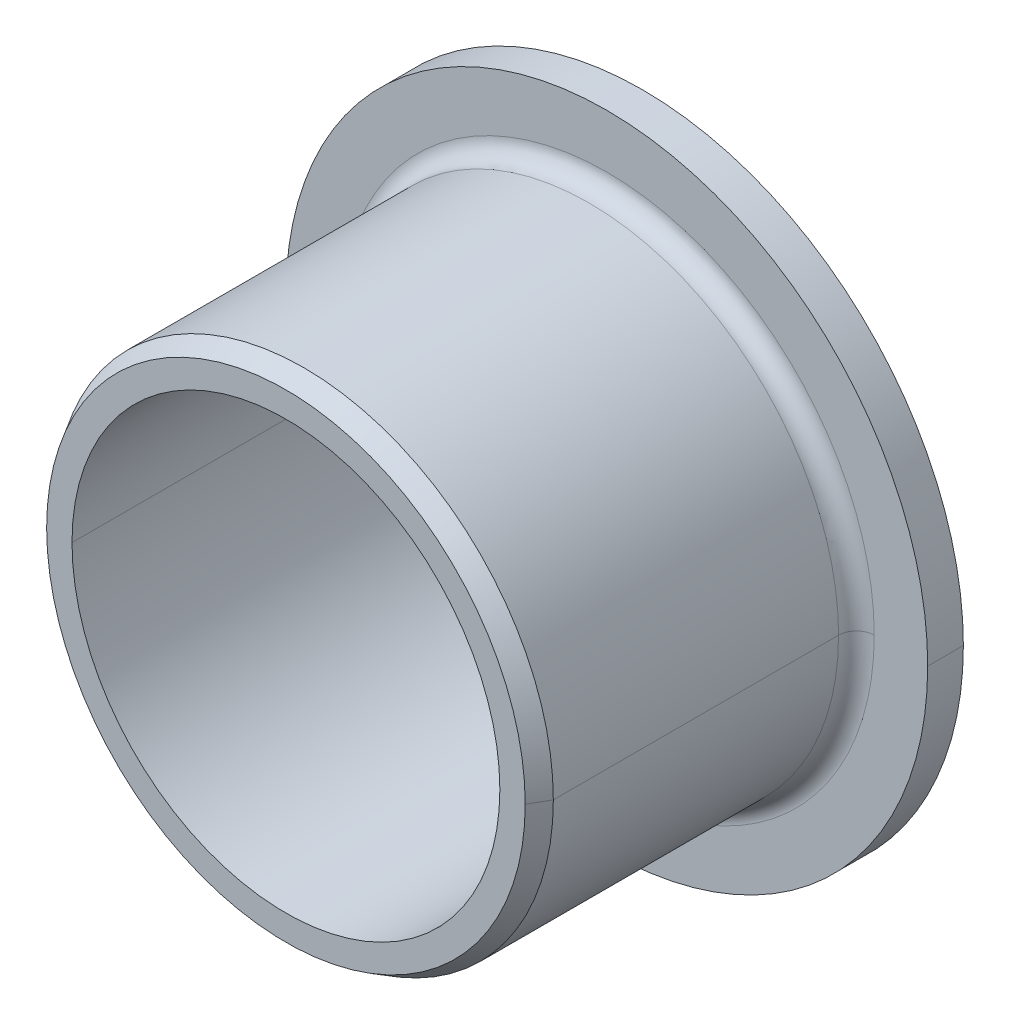
ISO-10303-21;
HEADER;
FILE_DESCRIPTION(('STEP AP214'),'2;1');
FILE_NAME('part.step','',(''),(''),'','','');
FILE_SCHEMA(('AUTOMOTIVE_DESIGN { 1 0 10303 214 1 1 1 1 }'));
ENDSEC;
DATA;
#1=APPLICATION_CONTEXT('core data for automotive mechanical design processes');
#2=APPLICATION_PROTOCOL_DEFINITION('international standard','automotive_design',2000,#1);
#3=PRODUCT_CONTEXT('',#1,'mechanical');
#4=PRODUCT('Part','Part','',(#3));
#5=PRODUCT_RELATED_PRODUCT_CATEGORY('part','',(#4));
#6=PRODUCT_DEFINITION_FORMATION('','',#4);
#7=PRODUCT_DEFINITION_CONTEXT('part definition',#1,'design');
#8=PRODUCT_DEFINITION('design','',#6,#7);
#9=PRODUCT_DEFINITION_SHAPE('','',#8);
#10=(LENGTH_UNIT() NAMED_UNIT(*) SI_UNIT(.MILLI.,.METRE.));
#11=(NAMED_UNIT(*) PLANE_ANGLE_UNIT() SI_UNIT($,.RADIAN.));
#12=(NAMED_UNIT(*) SI_UNIT($,.STERADIAN.) SOLID_ANGLE_UNIT());
#13=UNCERTAINTY_MEASURE_WITH_UNIT(LENGTH_MEASURE(1.E-05),#10,'distance_accuracy_value','');
#14=(GEOMETRIC_REPRESENTATION_CONTEXT(3) GLOBAL_UNCERTAINTY_ASSIGNED_CONTEXT((#13)) GLOBAL_UNIT_ASSIGNED_CONTEXT((#10,
#11,#12)) REPRESENTATION_CONTEXT('',''));
#15=CARTESIAN_POINT('',(0.,0.,0.));
#16=DIRECTION('',(0.,0.,1.));
#17=DIRECTION('',(1.,0.,0.));
#18=AXIS2_PLACEMENT_3D('',#15,#16,#17);
#19=CARTESIAN_POINT('',(7.5,0.,0.));
#20=DIRECTION('',(0.,0.,-1.));
#21=DIRECTION('',(0.,-1.,0.));
#22=AXIS2_PLACEMENT_3D('',#19,#20,#21);
#23=PLANE('',#22);
#24=CARTESIAN_POINT('',(0.,0.,0.));
#25=DIRECTION('',(0.,0.,1.));
#26=DIRECTION('',(1.,0.,0.));
#27=AXIS2_PLACEMENT_3D('',#24,#25,#26);
#28=CIRCLE('',#27,6.);
#29=CARTESIAN_POINT('',(6.,0.,0.));
#30=VERTEX_POINT('',#29);
#31=CARTESIAN_POINT('',(-6.,0.,0.));
#32=VERTEX_POINT('',#31);
#33=EDGE_CURVE('E10',#30,#32,#28,.T.);
#34=ORIENTED_EDGE('',*,*,#33,.T.);
#35=CARTESIAN_POINT('',(0.,0.,0.));
#36=DIRECTION('',(0.,0.,1.));
#37=DIRECTION('',(1.,0.,0.));
#38=AXIS2_PLACEMENT_3D('',#35,#36,#37);
#39=CIRCLE('',#38,6.);
#40=EDGE_CURVE('E326',#32,#30,#39,.T.);
#41=ORIENTED_EDGE('',*,*,#40,.T.);
#42=EDGE_LOOP('',(#34,#41));
#43=FACE_BOUND('',#42,.T.);
#44=CARTESIAN_POINT('',(0.,0.,0.));
#45=DIRECTION('',(0.,0.,1.));
#46=DIRECTION('',(1.,0.,0.));
#47=AXIS2_PLACEMENT_3D('',#44,#45,#46);
#48=CIRCLE('',#47,9.);
#49=CARTESIAN_POINT('',(9.,0.,0.));
#50=VERTEX_POINT('',#49);
#51=CARTESIAN_POINT('',(-9.,0.,0.));
#52=VERTEX_POINT('',#51);
#53=EDGE_CURVE('E402',#50,#52,#48,.T.);
#54=ORIENTED_EDGE('',*,*,#53,.F.);
#55=CARTESIAN_POINT('',(0.,0.,0.));
#56=DIRECTION('',(0.,0.,1.));
#57=DIRECTION('',(1.,0.,0.));
#58=AXIS2_PLACEMENT_3D('',#55,#56,#57);
#59=CIRCLE('',#58,9.);
#60=EDGE_CURVE('E101',#52,#50,#59,.T.);
#61=ORIENTED_EDGE('',*,*,#60,.F.);
#62=EDGE_LOOP('',(#54,#61));
#63=FACE_BOUND('',#62,.T.);
#64=ADVANCED_FACE('F16',(#43,#63),#23,.T.);
#65=CARTESIAN_POINT('',(0.,0.,5.));
#66=DIRECTION('',(0.,0.,1.));
#67=DIRECTION('',(1.,0.,0.));
#68=AXIS2_PLACEMENT_3D('',#65,#66,#67);
#69=CYLINDRICAL_SURFACE('',#68,6.);
#70=DIRECTION('',(0.,0.,1.));
#71=VECTOR('',#70,1.);
#72=CARTESIAN_POINT('',(6.,0.,5.));
#73=LINE('',#72,#71);
#74=CARTESIAN_POINT('',(6.,0.,10.));
#75=VERTEX_POINT('',#74);
#76=EDGE_CURVE('E330',#30,#75,#73,.T.);
#77=ORIENTED_EDGE('',*,*,#76,.T.);
#78=CARTESIAN_POINT('',(0.,0.,10.));
#79=DIRECTION('',(0.,0.,1.));
#80=DIRECTION('',(1.,0.,0.));
#81=AXIS2_PLACEMENT_3D('',#78,#79,#80);
#82=CIRCLE('',#81,6.);
#83=CARTESIAN_POINT('',(-6.,0.,10.));
#84=VERTEX_POINT('',#83);
#85=EDGE_CURVE('E27',#75,#84,#82,.T.);
#86=ORIENTED_EDGE('',*,*,#85,.T.);
#87=DIRECTION('',(0.,0.,-1.));
#88=VECTOR('',#87,1.);
#89=CARTESIAN_POINT('',(-6.,0.,5.));
#90=LINE('',#89,#88);
#91=EDGE_CURVE('E323',#84,#32,#90,.T.);
#92=ORIENTED_EDGE('',*,*,#91,.T.);
#93=ORIENTED_EDGE('',*,*,#33,.F.);
#94=EDGE_LOOP('',(#77,#86,#92,#93));
#95=FACE_BOUND('',#94,.T.);
#96=ADVANCED_FACE('F196',(#95),#69,.F.);
#97=CARTESIAN_POINT('',(6.3556624327,0.,10.));
#98=DIRECTION('',(0.,0.,1.));
#99=DIRECTION('',(1.,0.,0.));
#100=AXIS2_PLACEMENT_3D('',#97,#98,#99);
#101=PLANE('',#100);
#102=ORIENTED_EDGE('',*,*,#85,.F.);
#103=CARTESIAN_POINT('',(0.,0.,10.));
#104=DIRECTION('',(0.,0.,1.));
#105=DIRECTION('',(1.,0.,0.));
#106=AXIS2_PLACEMENT_3D('',#103,#104,#105);
#107=CIRCLE('',#106,6.);
#108=EDGE_CURVE('E316',#84,#75,#107,.T.);
#109=ORIENTED_EDGE('',*,*,#108,.F.);
#110=EDGE_LOOP('',(#102,#109));
#111=FACE_BOUND('',#110,.T.);
#112=CARTESIAN_POINT('',(0.,0.,10.));
#113=DIRECTION('',(0.,0.,1.));
#114=DIRECTION('',(1.,0.,0.));
#115=AXIS2_PLACEMENT_3D('',#112,#113,#114);
#116=CIRCLE('',#115,6.7113248654);
#117=CARTESIAN_POINT('',(6.7113248654,0.,10.));
#118=VERTEX_POINT('',#117);
#119=CARTESIAN_POINT('',(-6.7113248654,0.,10.));
#120=VERTEX_POINT('',#119);
#121=EDGE_CURVE('E20',#118,#120,#116,.T.);
#122=ORIENTED_EDGE('',*,*,#121,.T.);
#123=CARTESIAN_POINT('',(0.,0.,10.));
#124=DIRECTION('',(0.,0.,1.));
#125=DIRECTION('',(1.,0.,0.));
#126=AXIS2_PLACEMENT_3D('',#123,#124,#125);
#127=CIRCLE('',#126,6.7113248654);
#128=EDGE_CURVE('E83',#120,#118,#127,.T.);
#129=ORIENTED_EDGE('',*,*,#128,.T.);
#130=EDGE_LOOP('',(#122,#129));
#131=FACE_BOUND('',#130,.T.);
#132=ADVANCED_FACE('F201',(#111,#131),#101,.T.);
#133=CARTESIAN_POINT('',(0.,0.,9.75));
#134=DIRECTION('',(0.,0.,-1.));
#135=DIRECTION('',(1.,0.,0.));
#136=AXIS2_PLACEMENT_3D('',#133,#134,#135);
#137=CONICAL_SURFACE('',#136,6.8556624327,0.52359877560608);
#138=DIRECTION('',(-0.500000000006738,0.,0.866025403780548));
#139=VECTOR('',#138,1.);
#140=CARTESIAN_POINT('',(6.8556624327,0.,9.75));
#141=LINE('',#140,#139);
#142=CARTESIAN_POINT('',(7.,0.,9.5));
#143=VERTEX_POINT('',#142);
#144=EDGE_CURVE('E311',#143,#118,#141,.T.);
#145=ORIENTED_EDGE('',*,*,#144,.T.);
#146=ORIENTED_EDGE('',*,*,#128,.F.);
#147=DIRECTION('',(-0.500000000006738,0.,-0.866025403780548));
#148=VECTOR('',#147,1.);
#149=CARTESIAN_POINT('',(-6.8556624327,0.,9.75));
#150=LINE('',#149,#148);
#151=CARTESIAN_POINT('',(-7.,0.,9.5));
#152=VERTEX_POINT('',#151);
#153=EDGE_CURVE('E158',#120,#152,#150,.T.);
#154=ORIENTED_EDGE('',*,*,#153,.T.);
#155=CARTESIAN_POINT('',(0.,0.,9.5));
#156=DIRECTION('',(0.,0.,1.));
#157=DIRECTION('',(1.,0.,0.));
#158=AXIS2_PLACEMENT_3D('',#155,#156,#157);
#159=CIRCLE('',#158,7.);
#160=EDGE_CURVE('E73',#152,#143,#159,.T.);
#161=ORIENTED_EDGE('',*,*,#160,.T.);
#162=EDGE_LOOP('',(#145,#146,#154,#161));
#163=FACE_BOUND('',#162,.T.);
#164=ADVANCED_FACE('F18',(#163),#137,.T.);
#165=CARTESIAN_POINT('',(0.,0.,5.5));
#166=DIRECTION('',(0.,0.,1.));
#167=DIRECTION('',(1.,0.,0.));
#168=AXIS2_PLACEMENT_3D('',#165,#166,#167);
#169=CYLINDRICAL_SURFACE('',#168,7.);
#170=DIRECTION('',(0.,0.,1.));
#171=VECTOR('',#170,1.);
#172=CARTESIAN_POINT('',(7.,0.,5.5));
#173=LINE('',#172,#171);
#174=CARTESIAN_POINT('',(7.,0.,1.5));
#175=VERTEX_POINT('',#174);
#176=EDGE_CURVE('E157',#175,#143,#173,.T.);
#177=ORIENTED_EDGE('',*,*,#176,.T.);
#178=ORIENTED_EDGE('',*,*,#160,.F.);
#179=DIRECTION('',(0.,0.,-1.));
#180=VECTOR('',#179,1.);
#181=CARTESIAN_POINT('',(-7.,0.,5.5));
#182=LINE('',#181,#180);
#183=CARTESIAN_POINT('',(-7.,0.,1.5));
#184=VERTEX_POINT('',#183);
#185=EDGE_CURVE('E136',#152,#184,#182,.T.);
#186=ORIENTED_EDGE('',*,*,#185,.T.);
#187=CARTESIAN_POINT('',(0.,0.,1.5));
#188=DIRECTION('',(0.,0.,1.));
#189=DIRECTION('',(1.,0.,0.));
#190=AXIS2_PLACEMENT_3D('',#187,#188,#189);
#191=CIRCLE('',#190,7.);
#192=EDGE_CURVE('E134',#184,#175,#191,.T.);
#193=ORIENTED_EDGE('',*,*,#192,.T.);
#194=EDGE_LOOP('',(#177,#178,#186,#193));
#195=FACE_BOUND('',#194,.T.);
#196=ADVANCED_FACE('F177',(#195),#169,.T.);
#197=CARTESIAN_POINT('',(0.,0.,1.5));
#198=DIRECTION('',(0.,0.,1.));
#199=DIRECTION('',(1.,0.,0.));
#200=AXIS2_PLACEMENT_3D('',#197,#198,#199);
#201=TOROIDAL_SURFACE('',#200,7.5,0.5);
#202=CARTESIAN_POINT('',(-7.5,0.,1.5));
#203=DIRECTION('',(0.,-1.,0.));
#204=DIRECTION('',(-1.,0.,0.));
#205=AXIS2_PLACEMENT_3D('',#202,#203,#204);
#206=CIRCLE('',#205,0.5);
#207=CARTESIAN_POINT('',(-7.5,0.,1.));
#208=VERTEX_POINT('',#207);
#209=EDGE_CURVE('E120',#208,#184,#206,.T.);
#210=ORIENTED_EDGE('',*,*,#209,.T.);
#211=CARTESIAN_POINT('',(0.,0.,1.5));
#212=DIRECTION('',(0.,0.,1.));
#213=DIRECTION('',(1.,0.,0.));
#214=AXIS2_PLACEMENT_3D('',#211,#212,#213);
#215=CIRCLE('',#214,7.);
#216=EDGE_CURVE('E142',#175,#184,#215,.T.);
#217=ORIENTED_EDGE('',*,*,#216,.F.);
#218=CARTESIAN_POINT('',(7.5,0.,1.5));
#219=DIRECTION('',(0.,-1.,0.));
#220=DIRECTION('',(1.,0.,0.));
#221=AXIS2_PLACEMENT_3D('',#218,#219,#220);
#222=CIRCLE('',#221,0.5);
#223=CARTESIAN_POINT('',(7.5,0.,1.));
#224=VERTEX_POINT('',#223);
#225=EDGE_CURVE('E122',#175,#224,#222,.T.);
#226=ORIENTED_EDGE('',*,*,#225,.T.);
#227=CARTESIAN_POINT('',(0.,0.,1.));
#228=DIRECTION('',(0.,0.,1.));
#229=DIRECTION('',(1.,0.,0.));
#230=AXIS2_PLACEMENT_3D('',#227,#228,#229);
#231=CIRCLE('',#230,7.5);
#232=EDGE_CURVE('E111',#224,#208,#231,.T.);
#233=ORIENTED_EDGE('',*,*,#232,.T.);
#234=EDGE_LOOP('',(#210,#217,#226,#233));
#235=FACE_BOUND('',#234,.T.);
#236=ADVANCED_FACE('F117',(#235),#201,.F.);
#237=CARTESIAN_POINT('',(8.25,0.,1.));
#238=DIRECTION('',(0.,0.,1.));
#239=DIRECTION('',(1.,0.,0.));
#240=AXIS2_PLACEMENT_3D('',#237,#238,#239);
#241=PLANE('',#240);
#242=ORIENTED_EDGE('',*,*,#232,.F.);
#243=CARTESIAN_POINT('',(0.,0.,1.));
#244=DIRECTION('',(0.,0.,1.));
#245=DIRECTION('',(1.,0.,0.));
#246=AXIS2_PLACEMENT_3D('',#243,#244,#245);
#247=CIRCLE('',#246,7.5);
#248=EDGE_CURVE('E126',#208,#224,#247,.T.);
#249=ORIENTED_EDGE('',*,*,#248,.F.);
#250=EDGE_LOOP('',(#242,#249));
#251=FACE_BOUND('',#250,.T.);
#252=CARTESIAN_POINT('',(0.,0.,1.));
#253=DIRECTION('',(0.,0.,1.));
#254=DIRECTION('',(1.,0.,0.));
#255=AXIS2_PLACEMENT_3D('',#252,#253,#254);
#256=CIRCLE('',#255,9.);
#257=CARTESIAN_POINT('',(9.,0.,1.));
#258=VERTEX_POINT('',#257);
#259=CARTESIAN_POINT('',(-9.,0.,1.));
#260=VERTEX_POINT('',#259);
#261=EDGE_CURVE('E148',#258,#260,#256,.T.);
#262=ORIENTED_EDGE('',*,*,#261,.T.);
#263=CARTESIAN_POINT('',(0.,0.,1.));
#264=DIRECTION('',(0.,0.,1.));
#265=DIRECTION('',(1.,0.,0.));
#266=AXIS2_PLACEMENT_3D('',#263,#264,#265);
#267=CIRCLE('',#266,9.);
#268=EDGE_CURVE('E41',#260,#258,#267,.T.);
#269=ORIENTED_EDGE('',*,*,#268,.T.);
#270=EDGE_LOOP('',(#262,#269));
#271=FACE_BOUND('',#270,.T.);
#272=ADVANCED_FACE('F127',(#251,#271),#241,.T.);
#273=CARTESIAN_POINT('',(0.,0.,0.5));
#274=DIRECTION('',(0.,0.,1.));
#275=DIRECTION('',(1.,0.,0.));
#276=AXIS2_PLACEMENT_3D('',#273,#274,#275);
#277=CYLINDRICAL_SURFACE('',#276,9.);
#278=DIRECTION('',(0.,0.,1.));
#279=VECTOR('',#278,1.);
#280=CARTESIAN_POINT('',(9.,0.,0.5));
#281=LINE('',#280,#279);
#282=EDGE_CURVE('E396',#50,#258,#281,.T.);
#283=ORIENTED_EDGE('',*,*,#282,.T.);
#284=ORIENTED_EDGE('',*,*,#268,.F.);
#285=DIRECTION('',(0.,0.,-1.));
#286=VECTOR('',#285,1.);
#287=CARTESIAN_POINT('',(-9.,0.,0.5));
#288=LINE('',#287,#286);
#289=EDGE_CURVE('E146',#260,#52,#288,.T.);
#290=ORIENTED_EDGE('',*,*,#289,.T.);
#291=ORIENTED_EDGE('',*,*,#60,.T.);
#292=EDGE_LOOP('',(#283,#284,#290,#291));
#293=FACE_BOUND('',#292,.T.);
#294=ADVANCED_FACE('F189',(#293),#277,.T.);
#295=CARTESIAN_POINT('',(0.,0.,0.5));
#296=DIRECTION('',(0.,0.,1.));
#297=DIRECTION('',(1.,0.,0.));
#298=AXIS2_PLACEMENT_3D('',#295,#296,#297);
#299=CYLINDRICAL_SURFACE('',#298,9.);
#300=ORIENTED_EDGE('',*,*,#282,.F.);
#301=ORIENTED_EDGE('',*,*,#53,.T.);
#302=ORIENTED_EDGE('',*,*,#289,.F.);
#303=ORIENTED_EDGE('',*,*,#261,.F.);
#304=EDGE_LOOP('',(#300,#301,#302,#303));
#305=FACE_BOUND('',#304,.T.);
#306=ADVANCED_FACE('F184',(#305),#299,.T.);
#307=CARTESIAN_POINT('',(0.,0.,1.5));
#308=DIRECTION('',(0.,0.,1.));
#309=DIRECTION('',(1.,0.,0.));
#310=AXIS2_PLACEMENT_3D('',#307,#308,#309);
#311=TOROIDAL_SURFACE('',#310,7.5,0.5);
#312=ORIENTED_EDGE('',*,*,#209,.F.);
#313=ORIENTED_EDGE('',*,*,#248,.T.);
#314=ORIENTED_EDGE('',*,*,#225,.F.);
#315=ORIENTED_EDGE('',*,*,#192,.F.);
#316=EDGE_LOOP('',(#312,#313,#314,#315));
#317=FACE_BOUND('',#316,.T.);
#318=ADVANCED_FACE('F132',(#317),#311,.F.);
#319=CARTESIAN_POINT('',(0.,0.,5.5));
#320=DIRECTION('',(0.,0.,1.));
#321=DIRECTION('',(1.,0.,0.));
#322=AXIS2_PLACEMENT_3D('',#319,#320,#321);
#323=CYLINDRICAL_SURFACE('',#322,7.);
#324=ORIENTED_EDGE('',*,*,#176,.F.);
#325=ORIENTED_EDGE('',*,*,#216,.T.);
#326=ORIENTED_EDGE('',*,*,#185,.F.);
#327=CARTESIAN_POINT('',(0.,0.,9.5));
#328=DIRECTION('',(0.,0.,1.));
#329=DIRECTION('',(1.,0.,0.));
#330=AXIS2_PLACEMENT_3D('',#327,#328,#329);
#331=CIRCLE('',#330,7.);
#332=EDGE_CURVE('E315',#143,#152,#331,.T.);
#333=ORIENTED_EDGE('',*,*,#332,.F.);
#334=EDGE_LOOP('',(#324,#325,#326,#333));
#335=FACE_BOUND('',#334,.T.);
#336=ADVANCED_FACE('F159',(#335),#323,.T.);
#337=CARTESIAN_POINT('',(0.,0.,9.75));
#338=DIRECTION('',(0.,0.,-1.));
#339=DIRECTION('',(1.,0.,0.));
#340=AXIS2_PLACEMENT_3D('',#337,#338,#339);
#341=CONICAL_SURFACE('',#340,6.8556624327,0.52359877560608);
#342=ORIENTED_EDGE('',*,*,#144,.F.);
#343=ORIENTED_EDGE('',*,*,#332,.T.);
#344=ORIENTED_EDGE('',*,*,#153,.F.);
#345=ORIENTED_EDGE('',*,*,#121,.F.);
#346=EDGE_LOOP('',(#342,#343,#344,#345));
#347=FACE_BOUND('',#346,.T.);
#348=ADVANCED_FACE('F164',(#347),#341,.T.);
#349=CARTESIAN_POINT('',(0.,0.,5.));
#350=DIRECTION('',(0.,0.,1.));
#351=DIRECTION('',(1.,0.,0.));
#352=AXIS2_PLACEMENT_3D('',#349,#350,#351);
#353=CYLINDRICAL_SURFACE('',#352,6.);
#354=ORIENTED_EDGE('',*,*,#76,.F.);
#355=ORIENTED_EDGE('',*,*,#40,.F.);
#356=ORIENTED_EDGE('',*,*,#91,.F.);
#357=ORIENTED_EDGE('',*,*,#108,.T.);
#358=EDGE_LOOP('',(#354,#355,#356,#357));
#359=FACE_BOUND('',#358,.T.);
#360=ADVANCED_FACE('F250',(#359),#353,.F.);
#361=CLOSED_SHELL('',(#64,#96,#132,#164,#196,#236,#272,#294,#306,#318,#336,#348,#360));
#362=MANIFOLD_SOLID_BREP('B1',#361);
#363=ADVANCED_BREP_SHAPE_REPRESENTATION('',(#18,#362),#14);
#364=SHAPE_DEFINITION_REPRESENTATION(#9,#363);
ENDSEC;
END-ISO-10303-21;
